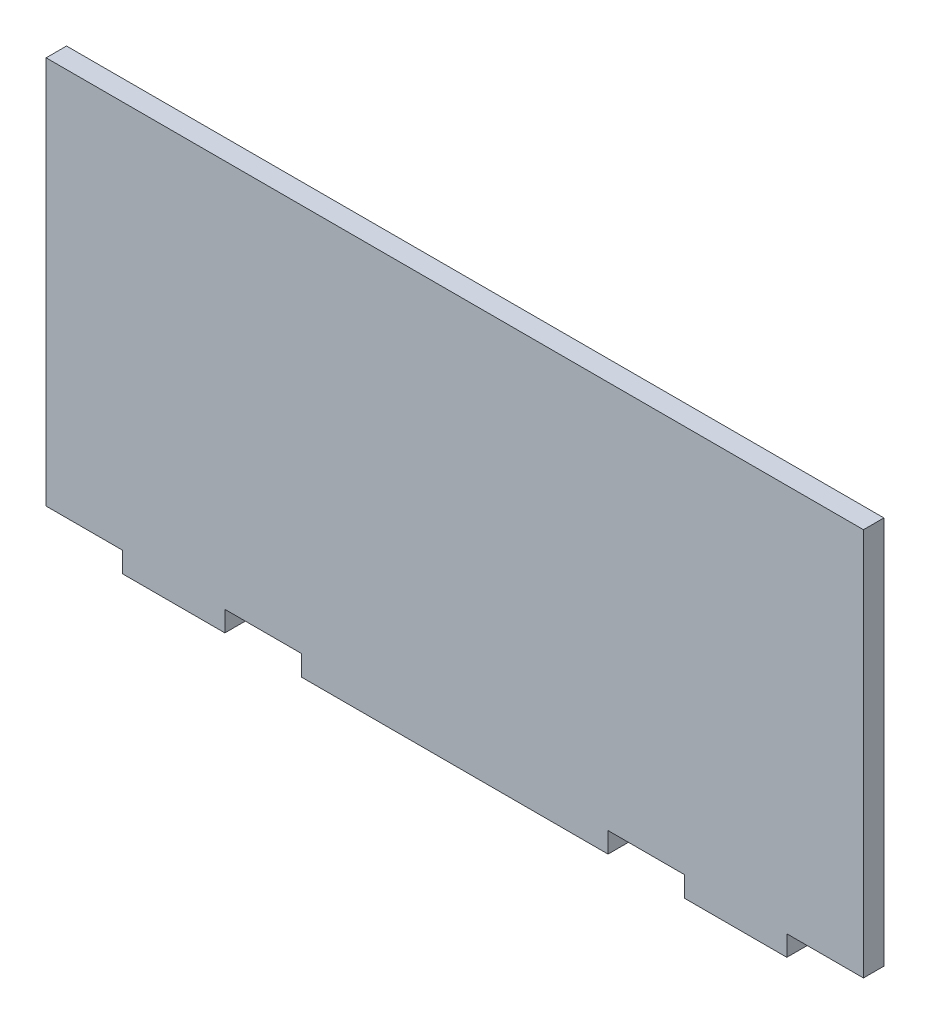
ISO-10303-21;
HEADER;
FILE_DESCRIPTION(('STEP AP214'),'2;1');
FILE_NAME('part.step','',(''),(''),'','','');
FILE_SCHEMA(('AUTOMOTIVE_DESIGN { 1 0 10303 214 1 1 1 1 }'));
ENDSEC;
DATA;
#1=APPLICATION_CONTEXT('core data for automotive mechanical design processes');
#2=APPLICATION_PROTOCOL_DEFINITION('international standard','automotive_design',2000,#1);
#3=PRODUCT_CONTEXT('',#1,'mechanical');
#4=PRODUCT('Part','Part','',(#3));
#5=PRODUCT_RELATED_PRODUCT_CATEGORY('part','',(#4));
#6=PRODUCT_DEFINITION_FORMATION('','',#4);
#7=PRODUCT_DEFINITION_CONTEXT('part definition',#1,'design');
#8=PRODUCT_DEFINITION('design','',#6,#7);
#9=PRODUCT_DEFINITION_SHAPE('','',#8);
#10=(LENGTH_UNIT() NAMED_UNIT(*) SI_UNIT(.MILLI.,.METRE.));
#11=(NAMED_UNIT(*) PLANE_ANGLE_UNIT() SI_UNIT($,.RADIAN.));
#12=(NAMED_UNIT(*) SI_UNIT($,.STERADIAN.) SOLID_ANGLE_UNIT());
#13=UNCERTAINTY_MEASURE_WITH_UNIT(LENGTH_MEASURE(1.E-05),#10,'distance_accuracy_value','');
#14=(GEOMETRIC_REPRESENTATION_CONTEXT(3) GLOBAL_UNCERTAINTY_ASSIGNED_CONTEXT((#13)) GLOBAL_UNIT_ASSIGNED_CONTEXT((#10,
#11,#12)) REPRESENTATION_CONTEXT('',''));
#15=CARTESIAN_POINT('',(0.,0.,0.));
#16=DIRECTION('',(0.,0.,1.));
#17=DIRECTION('',(1.,0.,0.));
#18=AXIS2_PLACEMENT_3D('',#15,#16,#17);
#19=CARTESIAN_POINT('',(-101.6,-50.8,5.08));
#20=DIRECTION('',(0.,1.,0.));
#21=DIRECTION('',(0.,0.,1.));
#22=AXIS2_PLACEMENT_3D('',#19,#20,#21);
#23=PLANE('',#22);
#24=DIRECTION('',(1.,0.,0.));
#25=VECTOR('',#24,1.);
#26=CARTESIAN_POINT('',(-101.6,-50.8,0.));
#27=LINE('',#26,#25);
#28=CARTESIAN_POINT('',(-82.55,-50.8,0.));
#29=VERTEX_POINT('',#28);
#30=CARTESIAN_POINT('',(-57.15,-50.8,0.));
#31=VERTEX_POINT('',#30);
#32=EDGE_CURVE('E164',#29,#31,#27,.T.);
#33=ORIENTED_EDGE('',*,*,#32,.T.);
#34=DIRECTION('',(0.,0.,1.));
#35=VECTOR('',#34,1.);
#36=CARTESIAN_POINT('',(-57.15,-50.8,-19.7157018642502));
#37=LINE('',#36,#35);
#38=CARTESIAN_POINT('',(-57.15,-50.8,5.08));
#39=VERTEX_POINT('',#38);
#40=EDGE_CURVE('E148',#31,#39,#37,.T.);
#41=ORIENTED_EDGE('',*,*,#40,.T.);
#42=DIRECTION('',(1.,0.,0.));
#43=VECTOR('',#42,1.);
#44=CARTESIAN_POINT('',(-101.6,-50.8,5.08));
#45=LINE('',#44,#43);
#46=CARTESIAN_POINT('',(-82.55,-50.8,5.08));
#47=VERTEX_POINT('',#46);
#48=EDGE_CURVE('E162',#47,#39,#45,.T.);
#49=ORIENTED_EDGE('',*,*,#48,.F.);
#50=DIRECTION('',(0.,0.,1.));
#51=VECTOR('',#50,1.);
#52=CARTESIAN_POINT('',(-82.55,-50.8,-19.7157018642502));
#53=LINE('',#52,#51);
#54=EDGE_CURVE('E191',#29,#47,#53,.T.);
#55=ORIENTED_EDGE('',*,*,#54,.F.);
#56=EDGE_LOOP('',(#33,#41,#49,#55));
#57=FACE_BOUND('',#56,.T.);
#58=ADVANCED_FACE('F33',(#57),#23,.F.);
#59=CARTESIAN_POINT('',(-38.1,-50.8,5.08));
#60=VERTEX_POINT('',#59);
#61=CARTESIAN_POINT('',(38.1,-50.8,5.08));
#62=VERTEX_POINT('',#61);
#63=EDGE_CURVE('E173',#60,#62,#45,.T.);
#64=ORIENTED_EDGE('',*,*,#63,.F.);
#65=DIRECTION('',(0.,0.,1.));
#66=VECTOR('',#65,1.);
#67=CARTESIAN_POINT('',(-38.1,-50.8,-19.7157018642502));
#68=LINE('',#67,#66);
#69=CARTESIAN_POINT('',(-38.1,-50.8,0.));
#70=VERTEX_POINT('',#69);
#71=EDGE_CURVE('E165',#70,#60,#68,.T.);
#72=ORIENTED_EDGE('',*,*,#71,.F.);
#73=CARTESIAN_POINT('',(38.1,-50.8,0.));
#74=VERTEX_POINT('',#73);
#75=EDGE_CURVE('E266',#70,#74,#27,.T.);
#76=ORIENTED_EDGE('',*,*,#75,.T.);
#77=DIRECTION('',(0.,0.,1.));
#78=VECTOR('',#77,1.);
#79=CARTESIAN_POINT('',(38.1,-50.8,-19.7157018642502));
#80=LINE('',#79,#78);
#81=EDGE_CURVE('E208',#74,#62,#80,.T.);
#82=ORIENTED_EDGE('',*,*,#81,.T.);
#83=EDGE_LOOP('',(#64,#72,#76,#82));
#84=FACE_BOUND('',#83,.T.);
#85=ADVANCED_FACE('F265',(#84),#23,.F.);
#86=CARTESIAN_POINT('',(101.6,50.8,5.08));
#87=DIRECTION('',(-1.,0.,0.));
#88=DIRECTION('',(0.,0.,1.));
#89=AXIS2_PLACEMENT_3D('',#86,#87,#88);
#90=PLANE('',#89);
#91=DIRECTION('',(0.,1.,0.));
#92=VECTOR('',#91,1.);
#93=CARTESIAN_POINT('',(101.6,50.8,5.08));
#94=LINE('',#93,#92);
#95=CARTESIAN_POINT('',(101.6,-45.72,5.08));
#96=VERTEX_POINT('',#95);
#97=CARTESIAN_POINT('',(101.6,50.8,5.08));
#98=VERTEX_POINT('',#97);
#99=EDGE_CURVE('E187',#96,#98,#94,.T.);
#100=ORIENTED_EDGE('',*,*,#99,.F.);
#101=DIRECTION('',(0.,0.,1.));
#102=VECTOR('',#101,1.);
#103=CARTESIAN_POINT('',(101.6,-45.72,-19.7157018642502));
#104=LINE('',#103,#102);
#105=CARTESIAN_POINT('',(101.6,-45.72,0.));
#106=VERTEX_POINT('',#105);
#107=EDGE_CURVE('E236',#106,#96,#104,.T.);
#108=ORIENTED_EDGE('',*,*,#107,.F.);
#109=DIRECTION('',(0.,1.,0.));
#110=VECTOR('',#109,1.);
#111=CARTESIAN_POINT('',(101.6,50.8,0.));
#112=LINE('',#111,#110);
#113=CARTESIAN_POINT('',(101.6,50.8,0.));
#114=VERTEX_POINT('',#113);
#115=EDGE_CURVE('E206',#106,#114,#112,.T.);
#116=ORIENTED_EDGE('',*,*,#115,.T.);
#117=DIRECTION('',(0.,0.,-1.));
#118=VECTOR('',#117,1.);
#119=CARTESIAN_POINT('',(101.6,50.8,5.08));
#120=LINE('',#119,#118);
#121=EDGE_CURVE('E11',#98,#114,#120,.T.);
#122=ORIENTED_EDGE('',*,*,#121,.F.);
#123=EDGE_LOOP('',(#100,#108,#116,#122));
#124=FACE_BOUND('',#123,.T.);
#125=ADVANCED_FACE('F35',(#124),#90,.F.);
#126=CARTESIAN_POINT('',(-101.6,50.8,5.08));
#127=DIRECTION('',(0.,-1.,0.));
#128=DIRECTION('',(0.,0.,-1.));
#129=AXIS2_PLACEMENT_3D('',#126,#127,#128);
#130=PLANE('',#129);
#131=DIRECTION('',(-1.,0.,0.));
#132=VECTOR('',#131,1.);
#133=CARTESIAN_POINT('',(-101.6,50.8,0.));
#134=LINE('',#133,#132);
#135=CARTESIAN_POINT('',(-101.6,50.8,0.));
#136=VERTEX_POINT('',#135);
#137=EDGE_CURVE('E278',#114,#136,#134,.T.);
#138=ORIENTED_EDGE('',*,*,#137,.T.);
#139=DIRECTION('',(0.,0.,-1.));
#140=VECTOR('',#139,1.);
#141=CARTESIAN_POINT('',(-101.6,50.8,5.08));
#142=LINE('',#141,#140);
#143=CARTESIAN_POINT('',(-101.6,50.8,5.08));
#144=VERTEX_POINT('',#143);
#145=EDGE_CURVE('E41',#144,#136,#142,.T.);
#146=ORIENTED_EDGE('',*,*,#145,.F.);
#147=DIRECTION('',(-1.,0.,0.));
#148=VECTOR('',#147,1.);
#149=CARTESIAN_POINT('',(-101.6,50.8,5.08));
#150=LINE('',#149,#148);
#151=EDGE_CURVE('E185',#98,#144,#150,.T.);
#152=ORIENTED_EDGE('',*,*,#151,.F.);
#153=ORIENTED_EDGE('',*,*,#121,.T.);
#154=EDGE_LOOP('',(#138,#146,#152,#153));
#155=FACE_BOUND('',#154,.T.);
#156=ADVANCED_FACE('F291',(#155),#130,.F.);
#157=CARTESIAN_POINT('',(-101.6,50.8,5.08));
#158=DIRECTION('',(1.,0.,0.));
#159=DIRECTION('',(0.,0.,-1.));
#160=AXIS2_PLACEMENT_3D('',#157,#158,#159);
#161=PLANE('',#160);
#162=DIRECTION('',(0.,-1.,0.));
#163=VECTOR('',#162,1.);
#164=CARTESIAN_POINT('',(-101.6,50.8,0.));
#165=LINE('',#164,#163);
#166=CARTESIAN_POINT('',(-101.6,-45.72,0.));
#167=VERTEX_POINT('',#166);
#168=EDGE_CURVE('E274',#136,#167,#165,.T.);
#169=ORIENTED_EDGE('',*,*,#168,.T.);
#170=DIRECTION('',(0.,0.,1.));
#171=VECTOR('',#170,1.);
#172=CARTESIAN_POINT('',(-101.6,-45.72,-19.7157018642502));
#173=LINE('',#172,#171);
#174=CARTESIAN_POINT('',(-101.6,-45.72,5.08));
#175=VERTEX_POINT('',#174);
#176=EDGE_CURVE('E196',#167,#175,#173,.T.);
#177=ORIENTED_EDGE('',*,*,#176,.T.);
#178=DIRECTION('',(0.,-1.,0.));
#179=VECTOR('',#178,1.);
#180=CARTESIAN_POINT('',(-101.6,50.8,5.08));
#181=LINE('',#180,#179);
#182=EDGE_CURVE('E180',#144,#175,#181,.T.);
#183=ORIENTED_EDGE('',*,*,#182,.F.);
#184=ORIENTED_EDGE('',*,*,#145,.T.);
#185=EDGE_LOOP('',(#169,#177,#183,#184));
#186=FACE_BOUND('',#185,.T.);
#187=ADVANCED_FACE('F331',(#186),#161,.F.);
#188=CARTESIAN_POINT('',(57.15,-50.8,0.));
#189=VERTEX_POINT('',#188);
#190=CARTESIAN_POINT('',(82.55,-50.8,0.));
#191=VERTEX_POINT('',#190);
#192=EDGE_CURVE('E271',#189,#191,#27,.T.);
#193=ORIENTED_EDGE('',*,*,#192,.T.);
#194=DIRECTION('',(0.,0.,1.));
#195=VECTOR('',#194,1.);
#196=CARTESIAN_POINT('',(82.55,-50.8,-19.7157018642502));
#197=LINE('',#196,#195);
#198=CARTESIAN_POINT('',(82.55,-50.8,5.08));
#199=VERTEX_POINT('',#198);
#200=EDGE_CURVE('E233',#191,#199,#197,.T.);
#201=ORIENTED_EDGE('',*,*,#200,.T.);
#202=CARTESIAN_POINT('',(57.15,-50.8,5.08));
#203=VERTEX_POINT('',#202);
#204=EDGE_CURVE('E175',#203,#199,#45,.T.);
#205=ORIENTED_EDGE('',*,*,#204,.F.);
#206=DIRECTION('',(0.,0.,1.));
#207=VECTOR('',#206,1.);
#208=CARTESIAN_POINT('',(57.15,-50.8,-19.7157018642502));
#209=LINE('',#208,#207);
#210=EDGE_CURVE('E211',#189,#203,#209,.T.);
#211=ORIENTED_EDGE('',*,*,#210,.F.);
#212=EDGE_LOOP('',(#193,#201,#205,#211));
#213=FACE_BOUND('',#212,.T.);
#214=ADVANCED_FACE('F300',(#213),#23,.F.);
#215=CARTESIAN_POINT('',(0.,0.,5.08));
#216=DIRECTION('',(0.,0.,1.));
#217=DIRECTION('',(1.,0.,0.));
#218=AXIS2_PLACEMENT_3D('',#215,#216,#217);
#219=PLANE('',#218);
#220=DIRECTION('',(0.,-1.,0.));
#221=VECTOR('',#220,1.);
#222=CARTESIAN_POINT('',(-57.15,-45.72,5.08));
#223=LINE('',#222,#221);
#224=CARTESIAN_POINT('',(-57.15,-45.72,5.08));
#225=VERTEX_POINT('',#224);
#226=EDGE_CURVE('E145',#225,#39,#223,.T.);
#227=ORIENTED_EDGE('',*,*,#226,.F.);
#228=DIRECTION('',(-1.,0.,0.));
#229=VECTOR('',#228,1.);
#230=CARTESIAN_POINT('',(-57.15,-45.72,5.08));
#231=LINE('',#230,#229);
#232=CARTESIAN_POINT('',(-38.1,-45.72,5.08));
#233=VERTEX_POINT('',#232);
#234=EDGE_CURVE('E166',#233,#225,#231,.T.);
#235=ORIENTED_EDGE('',*,*,#234,.F.);
#236=DIRECTION('',(0.,1.,0.));
#237=VECTOR('',#236,1.);
#238=CARTESIAN_POINT('',(-38.1,-45.72,5.08));
#239=LINE('',#238,#237);
#240=EDGE_CURVE('E156',#60,#233,#239,.T.);
#241=ORIENTED_EDGE('',*,*,#240,.F.);
#242=ORIENTED_EDGE('',*,*,#63,.T.);
#243=DIRECTION('',(0.,-1.,0.));
#244=VECTOR('',#243,1.);
#245=CARTESIAN_POINT('',(38.1,-45.72,5.08));
#246=LINE('',#245,#244);
#247=CARTESIAN_POINT('',(38.1,-45.72,5.08));
#248=VERTEX_POINT('',#247);
#249=EDGE_CURVE('E224',#248,#62,#246,.T.);
#250=ORIENTED_EDGE('',*,*,#249,.F.);
#251=DIRECTION('',(-1.,0.,0.));
#252=VECTOR('',#251,1.);
#253=CARTESIAN_POINT('',(38.1,-45.72,5.08));
#254=LINE('',#253,#252);
#255=CARTESIAN_POINT('',(57.15,-45.72,5.08));
#256=VERTEX_POINT('',#255);
#257=EDGE_CURVE('E212',#256,#248,#254,.T.);
#258=ORIENTED_EDGE('',*,*,#257,.F.);
#259=DIRECTION('',(0.,1.,0.));
#260=VECTOR('',#259,1.);
#261=CARTESIAN_POINT('',(57.15,-45.72,5.08));
#262=LINE('',#261,#260);
#263=EDGE_CURVE('E221',#203,#256,#262,.T.);
#264=ORIENTED_EDGE('',*,*,#263,.F.);
#265=ORIENTED_EDGE('',*,*,#204,.T.);
#266=DIRECTION('',(0.,-1.,0.));
#267=VECTOR('',#266,1.);
#268=CARTESIAN_POINT('',(82.55,-45.72,5.08));
#269=LINE('',#268,#267);
#270=CARTESIAN_POINT('',(82.55,-45.72,5.08));
#271=VERTEX_POINT('',#270);
#272=EDGE_CURVE('E242',#271,#199,#269,.T.);
#273=ORIENTED_EDGE('',*,*,#272,.F.);
#274=DIRECTION('',(-1.,0.,0.));
#275=VECTOR('',#274,1.);
#276=CARTESIAN_POINT('',(82.55,-45.72,5.08));
#277=LINE('',#276,#275);
#278=EDGE_CURVE('E237',#96,#271,#277,.T.);
#279=ORIENTED_EDGE('',*,*,#278,.F.);
#280=ORIENTED_EDGE('',*,*,#99,.T.);
#281=ORIENTED_EDGE('',*,*,#151,.T.);
#282=ORIENTED_EDGE('',*,*,#182,.T.);
#283=DIRECTION('',(-1.,0.,0.));
#284=VECTOR('',#283,1.);
#285=CARTESIAN_POINT('',(-101.6,-45.72,5.08));
#286=LINE('',#285,#284);
#287=CARTESIAN_POINT('',(-82.55,-45.72,5.08));
#288=VERTEX_POINT('',#287);
#289=EDGE_CURVE('E194',#288,#175,#286,.T.);
#290=ORIENTED_EDGE('',*,*,#289,.F.);
#291=DIRECTION('',(0.,1.,0.));
#292=VECTOR('',#291,1.);
#293=CARTESIAN_POINT('',(-82.55,-45.72,5.08));
#294=LINE('',#293,#292);
#295=EDGE_CURVE('E172',#47,#288,#294,.T.);
#296=ORIENTED_EDGE('',*,*,#295,.F.);
#297=ORIENTED_EDGE('',*,*,#48,.T.);
#298=EDGE_LOOP('',(#227,#235,#241,#242,#250,#258,#264,#265,#273,#279,#280,#281,#282,#290,#296,#297));
#299=FACE_BOUND('',#298,.T.);
#300=ADVANCED_FACE('F169',(#299),#219,.T.);
#301=CARTESIAN_POINT('',(0.,0.,0.));
#302=DIRECTION('',(0.,0.,1.));
#303=DIRECTION('',(1.,0.,0.));
#304=AXIS2_PLACEMENT_3D('',#301,#302,#303);
#305=PLANE('',#304);
#306=DIRECTION('',(1.,0.,0.));
#307=VECTOR('',#306,1.);
#308=CARTESIAN_POINT('',(-57.15,-45.72,0.));
#309=LINE('',#308,#307);
#310=CARTESIAN_POINT('',(-57.15,-45.72,0.));
#311=VERTEX_POINT('',#310);
#312=CARTESIAN_POINT('',(-38.1,-45.72,0.));
#313=VERTEX_POINT('',#312);
#314=EDGE_CURVE('E254',#311,#313,#309,.T.);
#315=ORIENTED_EDGE('',*,*,#314,.F.);
#316=DIRECTION('',(0.,1.,0.));
#317=VECTOR('',#316,1.);
#318=CARTESIAN_POINT('',(-57.15,-45.72,0.));
#319=LINE('',#318,#317);
#320=EDGE_CURVE('E244',#31,#311,#319,.T.);
#321=ORIENTED_EDGE('',*,*,#320,.F.);
#322=ORIENTED_EDGE('',*,*,#32,.F.);
#323=DIRECTION('',(0.,-1.,0.));
#324=VECTOR('',#323,1.);
#325=CARTESIAN_POINT('',(-82.55,-45.72,0.));
#326=LINE('',#325,#324);
#327=CARTESIAN_POINT('',(-82.55,-45.72,0.));
#328=VERTEX_POINT('',#327);
#329=EDGE_CURVE('E199',#328,#29,#326,.T.);
#330=ORIENTED_EDGE('',*,*,#329,.F.);
#331=DIRECTION('',(1.,0.,0.));
#332=VECTOR('',#331,1.);
#333=CARTESIAN_POINT('',(-101.6,-45.72,0.));
#334=LINE('',#333,#332);
#335=EDGE_CURVE('E203',#167,#328,#334,.T.);
#336=ORIENTED_EDGE('',*,*,#335,.F.);
#337=ORIENTED_EDGE('',*,*,#168,.F.);
#338=ORIENTED_EDGE('',*,*,#137,.F.);
#339=ORIENTED_EDGE('',*,*,#115,.F.);
#340=DIRECTION('',(1.,0.,0.));
#341=VECTOR('',#340,1.);
#342=CARTESIAN_POINT('',(82.55,-45.72,0.));
#343=LINE('',#342,#341);
#344=CARTESIAN_POINT('',(82.55,-45.72,0.));
#345=VERTEX_POINT('',#344);
#346=EDGE_CURVE('E240',#345,#106,#343,.T.);
#347=ORIENTED_EDGE('',*,*,#346,.F.);
#348=DIRECTION('',(0.,1.,0.));
#349=VECTOR('',#348,1.);
#350=CARTESIAN_POINT('',(82.55,-45.72,0.));
#351=LINE('',#350,#349);
#352=EDGE_CURVE('E227',#191,#345,#351,.T.);
#353=ORIENTED_EDGE('',*,*,#352,.F.);
#354=ORIENTED_EDGE('',*,*,#192,.F.);
#355=DIRECTION('',(0.,-1.,0.));
#356=VECTOR('',#355,1.);
#357=CARTESIAN_POINT('',(57.15,-45.72,0.));
#358=LINE('',#357,#356);
#359=CARTESIAN_POINT('',(57.15,-45.72,0.));
#360=VERTEX_POINT('',#359);
#361=EDGE_CURVE('E218',#360,#189,#358,.T.);
#362=ORIENTED_EDGE('',*,*,#361,.F.);
#363=DIRECTION('',(1.,0.,0.));
#364=VECTOR('',#363,1.);
#365=CARTESIAN_POINT('',(38.1,-45.72,0.));
#366=LINE('',#365,#364);
#367=CARTESIAN_POINT('',(38.1,-45.72,0.));
#368=VERTEX_POINT('',#367);
#369=EDGE_CURVE('E229',#368,#360,#366,.T.);
#370=ORIENTED_EDGE('',*,*,#369,.F.);
#371=DIRECTION('',(0.,1.,0.));
#372=VECTOR('',#371,1.);
#373=CARTESIAN_POINT('',(38.1,-45.72,0.));
#374=LINE('',#373,#372);
#375=EDGE_CURVE('E202',#74,#368,#374,.T.);
#376=ORIENTED_EDGE('',*,*,#375,.F.);
#377=ORIENTED_EDGE('',*,*,#75,.F.);
#378=DIRECTION('',(0.,-1.,0.));
#379=VECTOR('',#378,1.);
#380=CARTESIAN_POINT('',(-38.1,-45.72,0.));
#381=LINE('',#380,#379);
#382=EDGE_CURVE('E250',#313,#70,#381,.T.);
#383=ORIENTED_EDGE('',*,*,#382,.F.);
#384=EDGE_LOOP('',(#315,#321,#322,#330,#336,#337,#338,#339,#347,#353,#354,#362,#370,#376,#377,#383));
#385=FACE_BOUND('',#384,.T.);
#386=ADVANCED_FACE('F269',(#385),#305,.F.);
#387=CARTESIAN_POINT('',(-101.6,-45.72,-19.7157018642502));
#388=DIRECTION('',(0.,1.,0.));
#389=DIRECTION('',(0.,0.,1.));
#390=AXIS2_PLACEMENT_3D('',#387,#388,#389);
#391=PLANE('',#390);
#392=ORIENTED_EDGE('',*,*,#335,.T.);
#393=DIRECTION('',(0.,0.,1.));
#394=VECTOR('',#393,1.);
#395=CARTESIAN_POINT('',(-82.55,-45.72,-19.7157018642502));
#396=LINE('',#395,#394);
#397=EDGE_CURVE('E193',#328,#288,#396,.T.);
#398=ORIENTED_EDGE('',*,*,#397,.T.);
#399=ORIENTED_EDGE('',*,*,#289,.T.);
#400=ORIENTED_EDGE('',*,*,#176,.F.);
#401=EDGE_LOOP('',(#392,#398,#399,#400));
#402=FACE_BOUND('',#401,.T.);
#403=ADVANCED_FACE('F318',(#402),#391,.F.);
#404=CARTESIAN_POINT('',(-82.55,-45.72,-19.7157018642502));
#405=DIRECTION('',(1.,0.,0.));
#406=DIRECTION('',(0.,0.,-1.));
#407=AXIS2_PLACEMENT_3D('',#404,#405,#406);
#408=PLANE('',#407);
#409=ORIENTED_EDGE('',*,*,#329,.T.);
#410=ORIENTED_EDGE('',*,*,#54,.T.);
#411=ORIENTED_EDGE('',*,*,#295,.T.);
#412=ORIENTED_EDGE('',*,*,#397,.F.);
#413=EDGE_LOOP('',(#409,#410,#411,#412));
#414=FACE_BOUND('',#413,.T.);
#415=ADVANCED_FACE('F311',(#414),#408,.F.);
#416=CARTESIAN_POINT('',(38.1,-45.72,-19.7157018642502));
#417=DIRECTION('',(-1.,0.,0.));
#418=DIRECTION('',(0.,0.,1.));
#419=AXIS2_PLACEMENT_3D('',#416,#417,#418);
#420=PLANE('',#419);
#421=ORIENTED_EDGE('',*,*,#375,.T.);
#422=DIRECTION('',(0.,0.,1.));
#423=VECTOR('',#422,1.);
#424=CARTESIAN_POINT('',(38.1,-45.72,-19.7157018642502));
#425=LINE('',#424,#423);
#426=EDGE_CURVE('E216',#368,#248,#425,.T.);
#427=ORIENTED_EDGE('',*,*,#426,.T.);
#428=ORIENTED_EDGE('',*,*,#249,.T.);
#429=ORIENTED_EDGE('',*,*,#81,.F.);
#430=EDGE_LOOP('',(#421,#427,#428,#429));
#431=FACE_BOUND('',#430,.T.);
#432=ADVANCED_FACE('F309',(#431),#420,.F.);
#433=CARTESIAN_POINT('',(38.1,-45.72,-19.7157018642502));
#434=DIRECTION('',(0.,1.,0.));
#435=DIRECTION('',(0.,0.,1.));
#436=AXIS2_PLACEMENT_3D('',#433,#434,#435);
#437=PLANE('',#436);
#438=ORIENTED_EDGE('',*,*,#369,.T.);
#439=DIRECTION('',(0.,0.,1.));
#440=VECTOR('',#439,1.);
#441=CARTESIAN_POINT('',(57.15,-45.72,-19.7157018642502));
#442=LINE('',#441,#440);
#443=EDGE_CURVE('E214',#360,#256,#442,.T.);
#444=ORIENTED_EDGE('',*,*,#443,.T.);
#445=ORIENTED_EDGE('',*,*,#257,.T.);
#446=ORIENTED_EDGE('',*,*,#426,.F.);
#447=EDGE_LOOP('',(#438,#444,#445,#446));
#448=FACE_BOUND('',#447,.T.);
#449=ADVANCED_FACE('F307',(#448),#437,.F.);
#450=CARTESIAN_POINT('',(57.15,-45.72,-19.7157018642502));
#451=DIRECTION('',(1.,0.,0.));
#452=DIRECTION('',(0.,1.,0.));
#453=AXIS2_PLACEMENT_3D('',#450,#451,#452);
#454=PLANE('',#453);
#455=ORIENTED_EDGE('',*,*,#361,.T.);
#456=ORIENTED_EDGE('',*,*,#210,.T.);
#457=ORIENTED_EDGE('',*,*,#263,.T.);
#458=ORIENTED_EDGE('',*,*,#443,.F.);
#459=EDGE_LOOP('',(#455,#456,#457,#458));
#460=FACE_BOUND('',#459,.T.);
#461=ADVANCED_FACE('F302',(#460),#454,.F.);
#462=CARTESIAN_POINT('',(82.55,-45.72,-19.7157018642502));
#463=DIRECTION('',(-1.,0.,0.));
#464=DIRECTION('',(0.,0.,1.));
#465=AXIS2_PLACEMENT_3D('',#462,#463,#464);
#466=PLANE('',#465);
#467=ORIENTED_EDGE('',*,*,#352,.T.);
#468=DIRECTION('',(0.,0.,1.));
#469=VECTOR('',#468,1.);
#470=CARTESIAN_POINT('',(82.55,-45.72,-19.7157018642502));
#471=LINE('',#470,#469);
#472=EDGE_CURVE('E56',#345,#271,#471,.T.);
#473=ORIENTED_EDGE('',*,*,#472,.T.);
#474=ORIENTED_EDGE('',*,*,#272,.T.);
#475=ORIENTED_EDGE('',*,*,#200,.F.);
#476=EDGE_LOOP('',(#467,#473,#474,#475));
#477=FACE_BOUND('',#476,.T.);
#478=ADVANCED_FACE('F356',(#477),#466,.F.);
#479=CARTESIAN_POINT('',(82.55,-45.72,-19.7157018642502));
#480=DIRECTION('',(0.,1.,0.));
#481=DIRECTION('',(0.,0.,1.));
#482=AXIS2_PLACEMENT_3D('',#479,#480,#481);
#483=PLANE('',#482);
#484=ORIENTED_EDGE('',*,*,#346,.T.);
#485=ORIENTED_EDGE('',*,*,#107,.T.);
#486=ORIENTED_EDGE('',*,*,#278,.T.);
#487=ORIENTED_EDGE('',*,*,#472,.F.);
#488=EDGE_LOOP('',(#484,#485,#486,#487));
#489=FACE_BOUND('',#488,.T.);
#490=ADVANCED_FACE('F293',(#489),#483,.F.);
#491=CARTESIAN_POINT('',(-57.15,-45.72,-19.7157018642502));
#492=DIRECTION('',(-1.,0.,0.));
#493=DIRECTION('',(0.,0.,1.));
#494=AXIS2_PLACEMENT_3D('',#491,#492,#493);
#495=PLANE('',#494);
#496=ORIENTED_EDGE('',*,*,#320,.T.);
#497=DIRECTION('',(0.,0.,1.));
#498=VECTOR('',#497,1.);
#499=CARTESIAN_POINT('',(-57.15,-45.72,-19.7157018642502));
#500=LINE('',#499,#498);
#501=EDGE_CURVE('E151',#311,#225,#500,.T.);
#502=ORIENTED_EDGE('',*,*,#501,.T.);
#503=ORIENTED_EDGE('',*,*,#226,.T.);
#504=ORIENTED_EDGE('',*,*,#40,.F.);
#505=EDGE_LOOP('',(#496,#502,#503,#504));
#506=FACE_BOUND('',#505,.T.);
#507=ADVANCED_FACE('F147',(#506),#495,.F.);
#508=CARTESIAN_POINT('',(-57.15,-45.72,-19.7157018642502));
#509=DIRECTION('',(0.,1.,0.));
#510=DIRECTION('',(0.,0.,1.));
#511=AXIS2_PLACEMENT_3D('',#508,#509,#510);
#512=PLANE('',#511);
#513=ORIENTED_EDGE('',*,*,#314,.T.);
#514=DIRECTION('',(0.,0.,1.));
#515=VECTOR('',#514,1.);
#516=CARTESIAN_POINT('',(-38.1,-45.72,-19.7157018642502));
#517=LINE('',#516,#515);
#518=EDGE_CURVE('E48',#313,#233,#517,.T.);
#519=ORIENTED_EDGE('',*,*,#518,.T.);
#520=ORIENTED_EDGE('',*,*,#234,.T.);
#521=ORIENTED_EDGE('',*,*,#501,.F.);
#522=EDGE_LOOP('',(#513,#519,#520,#521));
#523=FACE_BOUND('',#522,.T.);
#524=ADVANCED_FACE('F344',(#523),#512,.F.);
#525=CARTESIAN_POINT('',(-38.1,-45.72,-19.7157018642502));
#526=DIRECTION('',(1.,0.,0.));
#527=DIRECTION('',(0.,0.,-1.));
#528=AXIS2_PLACEMENT_3D('',#525,#526,#527);
#529=PLANE('',#528);
#530=ORIENTED_EDGE('',*,*,#382,.T.);
#531=ORIENTED_EDGE('',*,*,#71,.T.);
#532=ORIENTED_EDGE('',*,*,#240,.T.);
#533=ORIENTED_EDGE('',*,*,#518,.F.);
#534=EDGE_LOOP('',(#530,#531,#532,#533));
#535=FACE_BOUND('',#534,.T.);
#536=ADVANCED_FACE('F258',(#535),#529,.F.);
#537=CLOSED_SHELL('',(#58,#85,#125,#156,#187,#214,#300,#386,#403,#415,#432,#449,#461,#478,#490,
#507,#524,#536));
#538=MANIFOLD_SOLID_BREP('B2',#537);
#539=ADVANCED_BREP_SHAPE_REPRESENTATION('',(#18,#538),#14);
#540=SHAPE_DEFINITION_REPRESENTATION(#9,#539);
ENDSEC;
END-ISO-10303-21;
